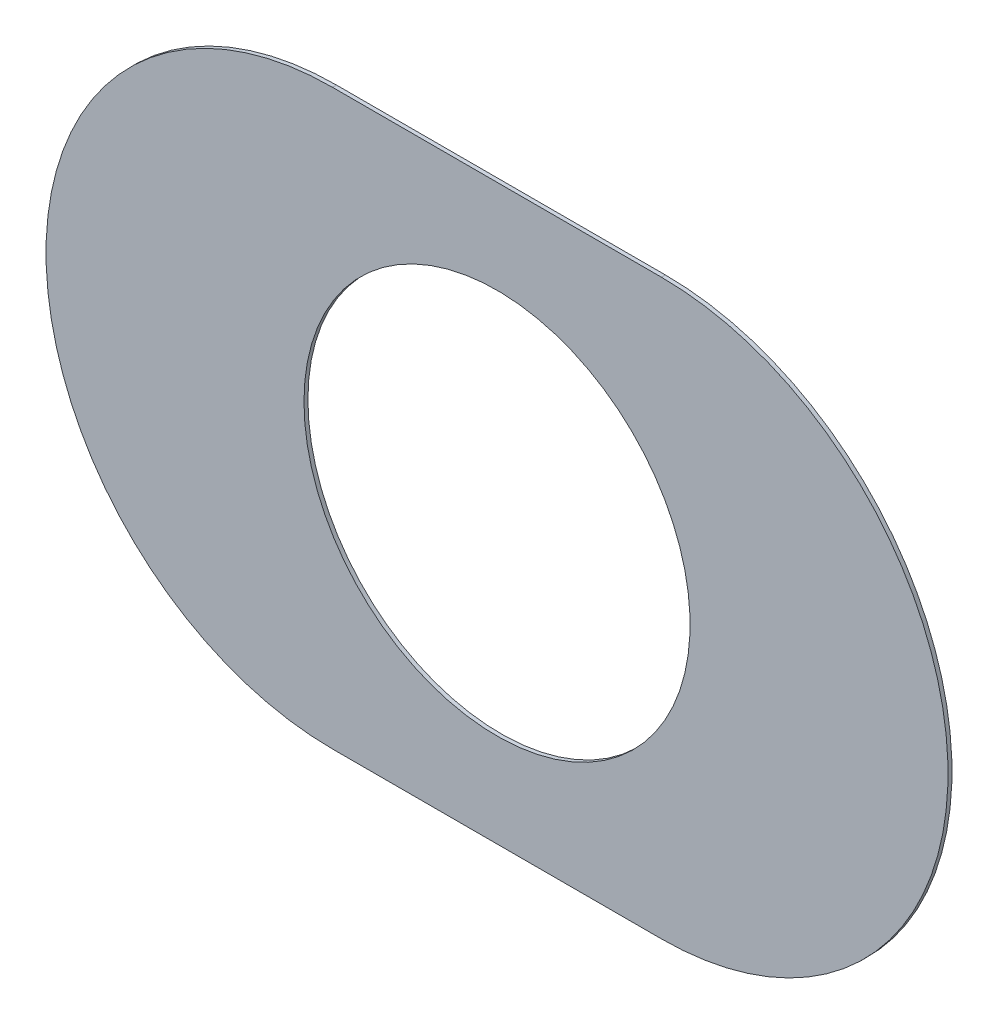
ISO-10303-21;
HEADER;
FILE_DESCRIPTION(('STEP AP214'),'2;1');
FILE_NAME('part.step','',(''),(''),'','','');
FILE_SCHEMA(('AUTOMOTIVE_DESIGN { 1 0 10303 214 1 1 1 1 }'));
ENDSEC;
DATA;
#1=APPLICATION_CONTEXT('core data for automotive mechanical design processes');
#2=APPLICATION_PROTOCOL_DEFINITION('international standard','automotive_design',2000,#1);
#3=PRODUCT_CONTEXT('',#1,'mechanical');
#4=PRODUCT('Part','Part','',(#3));
#5=PRODUCT_RELATED_PRODUCT_CATEGORY('part','',(#4));
#6=PRODUCT_DEFINITION_FORMATION('','',#4);
#7=PRODUCT_DEFINITION_CONTEXT('part definition',#1,'design');
#8=PRODUCT_DEFINITION('design','',#6,#7);
#9=PRODUCT_DEFINITION_SHAPE('','',#8);
#10=(LENGTH_UNIT() NAMED_UNIT(*) SI_UNIT(.MILLI.,.METRE.));
#11=(NAMED_UNIT(*) PLANE_ANGLE_UNIT() SI_UNIT($,.RADIAN.));
#12=(NAMED_UNIT(*) SI_UNIT($,.STERADIAN.) SOLID_ANGLE_UNIT());
#13=UNCERTAINTY_MEASURE_WITH_UNIT(LENGTH_MEASURE(1.E-05),#10,'distance_accuracy_value','');
#14=(GEOMETRIC_REPRESENTATION_CONTEXT(3) GLOBAL_UNCERTAINTY_ASSIGNED_CONTEXT((#13)) GLOBAL_UNIT_ASSIGNED_CONTEXT((#10,
#11,#12)) REPRESENTATION_CONTEXT('',''));
#15=CARTESIAN_POINT('',(0.,0.,0.));
#16=DIRECTION('',(0.,0.,1.));
#17=DIRECTION('',(1.,0.,0.));
#18=AXIS2_PLACEMENT_3D('',#15,#16,#17);
#19=CARTESIAN_POINT('',(1.54999965727325,27.2400006854535,0.));
#20=DIRECTION('',(0.,0.,-1.));
#21=DIRECTION('',(0.,-1.,0.));
#22=AXIS2_PLACEMENT_3D('',#19,#20,#21);
#23=PLANE('',#22);
#24=CARTESIAN_POINT('',(1.54999965727325,27.2400006854535,0.));
#25=DIRECTION('',(0.,0.,1.));
#26=DIRECTION('',(1.,0.,0.));
#27=AXIS2_PLACEMENT_3D('',#24,#25,#26);
#28=CIRCLE('',#27,0.49);
#29=CARTESIAN_POINT('',(1.05999965727325,27.2400006854535,0.));
#30=VERTEX_POINT('',#29);
#31=EDGE_CURVE('E95',#30,#30,#28,.T.);
#32=ORIENTED_EDGE('',*,*,#31,.F.);
#33=EDGE_LOOP('',(#32));
#34=FACE_BOUND('',#33,.T.);
#35=CARTESIAN_POINT('',(1.96740611181985,27.2400006854535,0.));
#36=DIRECTION('',(0.,0.,-1.));
#37=DIRECTION('',(0.,1.,0.));
#38=AXIS2_PLACEMENT_3D('',#35,#36,#37);
#39=CIRCLE('',#38,0.727257121659981);
#40=CARTESIAN_POINT('',(1.96740611181985,27.9672578071135,0.));
#41=VERTEX_POINT('',#40);
#42=CARTESIAN_POINT('',(1.96740611181985,26.5127435637935,0.));
#43=VERTEX_POINT('',#42);
#44=EDGE_CURVE('E27',#41,#43,#39,.T.);
#45=ORIENTED_EDGE('',*,*,#44,.F.);
#46=DIRECTION('',(1.,0.,0.));
#47=VECTOR('',#46,1.);
#48=CARTESIAN_POINT('',(1.13259320272665,27.9672578071135,0.));
#49=LINE('',#48,#47);
#50=CARTESIAN_POINT('',(1.13259320272665,27.9672578071135,0.));
#51=VERTEX_POINT('',#50);
#52=EDGE_CURVE('E76',#51,#41,#49,.T.);
#53=ORIENTED_EDGE('',*,*,#52,.F.);
#54=CARTESIAN_POINT('',(1.13259320272665,27.2400006854535,0.));
#55=DIRECTION('',(0.,0.,-1.));
#56=DIRECTION('',(0.,-1.,0.));
#57=AXIS2_PLACEMENT_3D('',#54,#55,#56);
#58=CIRCLE('',#57,0.727257121659981);
#59=CARTESIAN_POINT('',(1.13259320272665,26.5127435637935,0.));
#60=VERTEX_POINT('',#59);
#61=EDGE_CURVE('E104',#60,#51,#58,.T.);
#62=ORIENTED_EDGE('',*,*,#61,.F.);
#63=DIRECTION('',(-1.,0.,0.));
#64=VECTOR('',#63,1.);
#65=CARTESIAN_POINT('',(1.96740611181985,26.5127435637935,0.));
#66=LINE('',#65,#64);
#67=EDGE_CURVE('E78',#43,#60,#66,.T.);
#68=ORIENTED_EDGE('',*,*,#67,.F.);
#69=EDGE_LOOP('',(#45,#53,#62,#68));
#70=FACE_BOUND('',#69,.T.);
#71=ADVANCED_FACE('F17',(#34,#70),#23,.F.);
#72=CARTESIAN_POINT('',(1.54999965727325,27.2400006854535,-0.01));
#73=DIRECTION('',(0.,0.,-1.));
#74=DIRECTION('',(0.,-1.,0.));
#75=AXIS2_PLACEMENT_3D('',#72,#73,#74);
#76=PLANE('',#75);
#77=CARTESIAN_POINT('',(1.54999965727325,27.2400006854535,-0.01));
#78=DIRECTION('',(0.,0.,1.));
#79=DIRECTION('',(1.,0.,0.));
#80=AXIS2_PLACEMENT_3D('',#77,#78,#79);
#81=CIRCLE('',#80,0.49);
#82=CARTESIAN_POINT('',(1.05999965727325,27.2400006854535,-0.01));
#83=VERTEX_POINT('',#82);
#84=EDGE_CURVE('E120',#83,#83,#81,.T.);
#85=ORIENTED_EDGE('',*,*,#84,.T.);
#86=EDGE_LOOP('',(#85));
#87=FACE_BOUND('',#86,.T.);
#88=CARTESIAN_POINT('',(1.96740611181985,27.2400006854535,-0.01));
#89=DIRECTION('',(0.,0.,-1.));
#90=DIRECTION('',(0.,1.,0.));
#91=AXIS2_PLACEMENT_3D('',#88,#89,#90);
#92=CIRCLE('',#91,0.727257121659981);
#93=CARTESIAN_POINT('',(1.96740611181985,27.9672578071135,-0.01));
#94=VERTEX_POINT('',#93);
#95=CARTESIAN_POINT('',(1.96740611181985,26.5127435637935,-0.01));
#96=VERTEX_POINT('',#95);
#97=EDGE_CURVE('E11',#94,#96,#92,.T.);
#98=ORIENTED_EDGE('',*,*,#97,.T.);
#99=DIRECTION('',(-1.,0.,0.));
#100=VECTOR('',#99,1.);
#101=CARTESIAN_POINT('',(1.96740611181985,26.5127435637935,-0.01));
#102=LINE('',#101,#100);
#103=CARTESIAN_POINT('',(1.13259320272665,26.5127435637935,-0.01));
#104=VERTEX_POINT('',#103);
#105=EDGE_CURVE('E124',#96,#104,#102,.T.);
#106=ORIENTED_EDGE('',*,*,#105,.T.);
#107=CARTESIAN_POINT('',(1.13259320272665,27.2400006854535,-0.01));
#108=DIRECTION('',(0.,0.,-1.));
#109=DIRECTION('',(0.,-1.,0.));
#110=AXIS2_PLACEMENT_3D('',#107,#108,#109);
#111=CIRCLE('',#110,0.727257121659981);
#112=CARTESIAN_POINT('',(1.13259320272665,27.9672578071135,-0.01));
#113=VERTEX_POINT('',#112);
#114=EDGE_CURVE('E105',#104,#113,#111,.T.);
#115=ORIENTED_EDGE('',*,*,#114,.T.);
#116=DIRECTION('',(1.,0.,0.));
#117=VECTOR('',#116,1.);
#118=CARTESIAN_POINT('',(1.13259320272665,27.9672578071135,-0.01));
#119=LINE('',#118,#117);
#120=EDGE_CURVE('E88',#113,#94,#119,.T.);
#121=ORIENTED_EDGE('',*,*,#120,.T.);
#122=EDGE_LOOP('',(#98,#106,#115,#121));
#123=FACE_BOUND('',#122,.T.);
#124=ADVANCED_FACE('F138',(#87,#123),#76,.T.);
#125=CARTESIAN_POINT('',(1.96740611181985,27.2400006854535,0.));
#126=DIRECTION('',(0.,0.,-1.));
#127=DIRECTION('',(0.,1.,0.));
#128=AXIS2_PLACEMENT_3D('',#125,#126,#127);
#129=CYLINDRICAL_SURFACE('',#128,0.727257121659981);
#130=ORIENTED_EDGE('',*,*,#44,.T.);
#131=DIRECTION('',(0.,0.,-1.));
#132=VECTOR('',#131,1.);
#133=CARTESIAN_POINT('',(1.96740611181985,26.5127435637935,0.));
#134=LINE('',#133,#132);
#135=EDGE_CURVE('E80',#43,#96,#134,.T.);
#136=ORIENTED_EDGE('',*,*,#135,.T.);
#137=ORIENTED_EDGE('',*,*,#97,.F.);
#138=DIRECTION('',(0.,0.,-1.));
#139=VECTOR('',#138,1.);
#140=CARTESIAN_POINT('',(1.96740611181985,27.9672578071135,0.));
#141=LINE('',#140,#139);
#142=EDGE_CURVE('E83',#41,#94,#141,.T.);
#143=ORIENTED_EDGE('',*,*,#142,.F.);
#144=EDGE_LOOP('',(#130,#136,#137,#143));
#145=FACE_BOUND('',#144,.T.);
#146=ADVANCED_FACE('F84',(#145),#129,.T.);
#147=CARTESIAN_POINT('',(1.96740611181985,26.5127435637935,0.));
#148=DIRECTION('',(0.,-1.,0.));
#149=DIRECTION('',(0.,0.,-1.));
#150=AXIS2_PLACEMENT_3D('',#147,#148,#149);
#151=PLANE('',#150);
#152=ORIENTED_EDGE('',*,*,#67,.T.);
#153=DIRECTION('',(0.,0.,-1.));
#154=VECTOR('',#153,1.);
#155=CARTESIAN_POINT('',(1.13259320272665,26.5127435637935,0.));
#156=LINE('',#155,#154);
#157=EDGE_CURVE('E21',#60,#104,#156,.T.);
#158=ORIENTED_EDGE('',*,*,#157,.T.);
#159=ORIENTED_EDGE('',*,*,#105,.F.);
#160=ORIENTED_EDGE('',*,*,#135,.F.);
#161=EDGE_LOOP('',(#152,#158,#159,#160));
#162=FACE_BOUND('',#161,.T.);
#163=ADVANCED_FACE('F136',(#162),#151,.T.);
#164=CARTESIAN_POINT('',(1.13259320272665,27.2400006854535,0.));
#165=DIRECTION('',(0.,0.,-1.));
#166=DIRECTION('',(0.,-1.,0.));
#167=AXIS2_PLACEMENT_3D('',#164,#165,#166);
#168=CYLINDRICAL_SURFACE('',#167,0.727257121659981);
#169=ORIENTED_EDGE('',*,*,#61,.T.);
#170=DIRECTION('',(0.,0.,-1.));
#171=VECTOR('',#170,1.);
#172=CARTESIAN_POINT('',(1.13259320272665,27.9672578071135,0.));
#173=LINE('',#172,#171);
#174=EDGE_CURVE('E93',#51,#113,#173,.T.);
#175=ORIENTED_EDGE('',*,*,#174,.T.);
#176=ORIENTED_EDGE('',*,*,#114,.F.);
#177=ORIENTED_EDGE('',*,*,#157,.F.);
#178=EDGE_LOOP('',(#169,#175,#176,#177));
#179=FACE_BOUND('',#178,.T.);
#180=ADVANCED_FACE('F137',(#179),#168,.T.);
#181=CARTESIAN_POINT('',(1.13259320272665,27.9672578071135,0.));
#182=DIRECTION('',(0.,1.,0.));
#183=DIRECTION('',(1.,0.,0.));
#184=AXIS2_PLACEMENT_3D('',#181,#182,#183);
#185=PLANE('',#184);
#186=ORIENTED_EDGE('',*,*,#52,.T.);
#187=ORIENTED_EDGE('',*,*,#142,.T.);
#188=ORIENTED_EDGE('',*,*,#120,.F.);
#189=ORIENTED_EDGE('',*,*,#174,.F.);
#190=EDGE_LOOP('',(#186,#187,#188,#189));
#191=FACE_BOUND('',#190,.T.);
#192=ADVANCED_FACE('F91',(#191),#185,.T.);
#193=CARTESIAN_POINT('',(1.54999965727325,27.2400006854535,0.));
#194=DIRECTION('',(0.,0.,-1.));
#195=DIRECTION('',(1.,0.,0.));
#196=AXIS2_PLACEMENT_3D('',#193,#194,#195);
#197=CYLINDRICAL_SURFACE('',#196,0.49);
#198=ORIENTED_EDGE('',*,*,#84,.F.);
#199=DIRECTION('',(0.,0.,1.));
#200=VECTOR('',#199,1.);
#201=CARTESIAN_POINT('',(1.05999965727325,27.2400006854535,0.));
#202=LINE('',#201,#200);
#203=EDGE_CURVE('E101',#83,#30,#202,.T.);
#204=ORIENTED_EDGE('',*,*,#203,.T.);
#205=ORIENTED_EDGE('',*,*,#31,.T.);
#206=ORIENTED_EDGE('',*,*,#203,.F.);
#207=EDGE_LOOP('',(#198,#204,#205,#206));
#208=FACE_BOUND('',#207,.T.);
#209=ADVANCED_FACE('F19',(#208),#197,.F.);
#210=CLOSED_SHELL('',(#71,#124,#146,#163,#180,#192,#209));
#211=MANIFOLD_SOLID_BREP('B1',#210);
#212=ADVANCED_BREP_SHAPE_REPRESENTATION('',(#18,#211),#14);
#213=SHAPE_DEFINITION_REPRESENTATION(#9,#212);
ENDSEC;
END-ISO-10303-21;
